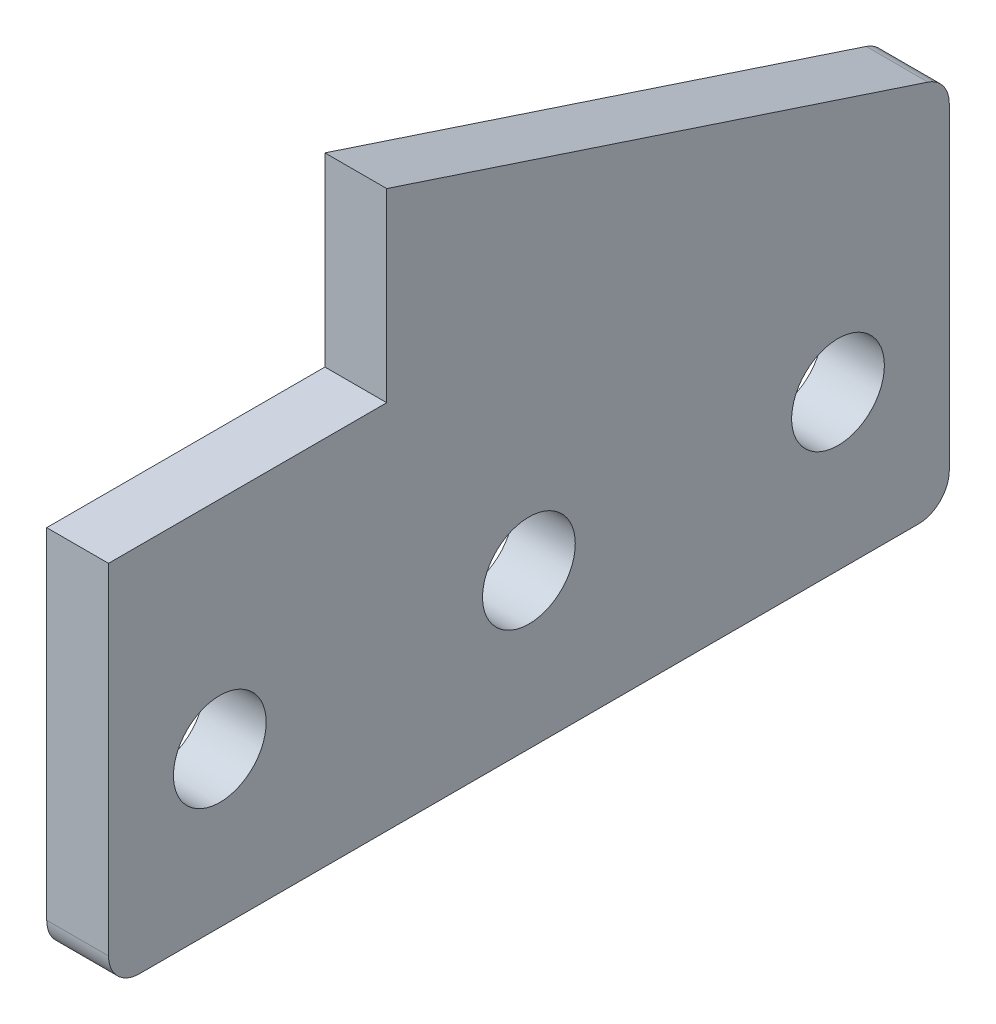
ISO-10303-21;
HEADER;
FILE_DESCRIPTION(('STEP AP214'),'2;1');
FILE_NAME('part.step','',(''),(''),'','','');
FILE_SCHEMA(('AUTOMOTIVE_DESIGN { 1 0 10303 214 1 1 1 1 }'));
ENDSEC;
DATA;
#1=APPLICATION_CONTEXT('core data for automotive mechanical design processes');
#2=APPLICATION_PROTOCOL_DEFINITION('international standard','automotive_design',2000,#1);
#3=PRODUCT_CONTEXT('',#1,'mechanical');
#4=PRODUCT('Part','Part','',(#3));
#5=PRODUCT_RELATED_PRODUCT_CATEGORY('part','',(#4));
#6=PRODUCT_DEFINITION_FORMATION('','',#4);
#7=PRODUCT_DEFINITION_CONTEXT('part definition',#1,'design');
#8=PRODUCT_DEFINITION('design','',#6,#7);
#9=PRODUCT_DEFINITION_SHAPE('','',#8);
#10=(LENGTH_UNIT() NAMED_UNIT(*) SI_UNIT(.MILLI.,.METRE.));
#11=(NAMED_UNIT(*) PLANE_ANGLE_UNIT() SI_UNIT($,.RADIAN.));
#12=(NAMED_UNIT(*) SI_UNIT($,.STERADIAN.) SOLID_ANGLE_UNIT());
#13=UNCERTAINTY_MEASURE_WITH_UNIT(LENGTH_MEASURE(1.E-05),#10,'distance_accuracy_value','');
#14=(GEOMETRIC_REPRESENTATION_CONTEXT(3) GLOBAL_UNCERTAINTY_ASSIGNED_CONTEXT((#13)) GLOBAL_UNIT_ASSIGNED_CONTEXT((#10,
#11,#12)) REPRESENTATION_CONTEXT('',''));
#15=CARTESIAN_POINT('',(0.,0.,0.));
#16=DIRECTION('',(0.,0.,1.));
#17=DIRECTION('',(1.,0.,0.));
#18=AXIS2_PLACEMENT_3D('',#15,#16,#17);
#19=CARTESIAN_POINT('',(-21.0000000000007,0.,-22.5));
#20=DIRECTION('',(0.,0.,1.));
#21=DIRECTION('',(1.,0.,0.));
#22=AXIS2_PLACEMENT_3D('',#19,#20,#21);
#23=PLANE('',#22);
#24=DIRECTION('',(0.,0.999999999999997,0.));
#25=VECTOR('',#24,1.);
#26=CARTESIAN_POINT('',(-31.0000000000002,0.,-22.4999999999995));
#27=LINE('',#26,#25);
#28=CARTESIAN_POINT('',(-31.0000000000004,-22.4999999999997,-22.4999999999989));
#29=VERTEX_POINT('',#28);
#30=CARTESIAN_POINT('',(-31.0000000000006,7.50000000000033,-22.4999999999995));
#31=VERTEX_POINT('',#30);
#32=EDGE_CURVE('E114',#29,#31,#27,.T.);
#33=ORIENTED_EDGE('',*,*,#32,.F.);
#34=DIRECTION('',(-1.,0.,0.));
#35=VECTOR('',#34,1.);
#36=CARTESIAN_POINT('',(-21.0000000000004,-22.4999999999995,-22.4999999999982));
#37=LINE('',#36,#35);
#38=CARTESIAN_POINT('',(-21.0000000000004,-22.4999999999995,-22.4999999999982));
#39=VERTEX_POINT('',#38);
#40=EDGE_CURVE('E109',#39,#29,#37,.T.);
#41=ORIENTED_EDGE('',*,*,#40,.F.);
#42=DIRECTION('',(0.,0.999999999999997,0.));
#43=VECTOR('',#42,1.);
#44=CARTESIAN_POINT('',(-21.0000000000007,0.,-22.5));
#45=LINE('',#44,#43);
#46=CARTESIAN_POINT('',(-21.,7.49999999999989,-22.5));
#47=VERTEX_POINT('',#46);
#48=EDGE_CURVE('E112',#39,#47,#45,.T.);
#49=ORIENTED_EDGE('',*,*,#48,.T.);
#50=DIRECTION('',(-1.,0.,0.));
#51=VECTOR('',#50,1.);
#52=CARTESIAN_POINT('',(-21.,7.49999999999989,-22.5));
#53=LINE('',#52,#51);
#54=EDGE_CURVE('E143',#47,#31,#53,.T.);
#55=ORIENTED_EDGE('',*,*,#54,.T.);
#56=EDGE_LOOP('',(#33,#41,#49,#55));
#57=FACE_BOUND('',#56,.T.);
#58=ADVANCED_FACE('F36',(#57),#23,.T.);
#59=CARTESIAN_POINT('',(-21.0000000000008,-22.4999999999998,1.33226762955019E-12));
#60=DIRECTION('',(0.,0.999999999999997,0.));
#61=DIRECTION('',(0.,0.,1.));
#62=AXIS2_PLACEMENT_3D('',#59,#60,#61);
#63=PLANE('',#62);
#64=DIRECTION('',(0.,0.,-1.));
#65=VECTOR('',#64,1.);
#66=CARTESIAN_POINT('',(-31.0000000000008,-22.4999999999994,1.77635683940025E-12));
#67=LINE('',#66,#65);
#68=CARTESIAN_POINT('',(-31.0000000000001,-22.4999999999998,22.5000000000013));
#69=VERTEX_POINT('',#68);
#70=EDGE_CURVE('E154',#69,#29,#67,.T.);
#71=ORIENTED_EDGE('',*,*,#70,.F.);
#72=DIRECTION('',(-1.,0.,0.));
#73=VECTOR('',#72,1.);
#74=CARTESIAN_POINT('',(-21.0000000000005,-22.5,22.5000000000011));
#75=LINE('',#74,#73);
#76=CARTESIAN_POINT('',(-21.0000000000005,-22.5,22.5000000000011));
#77=VERTEX_POINT('',#76);
#78=EDGE_CURVE('E120',#77,#69,#75,.T.);
#79=ORIENTED_EDGE('',*,*,#78,.F.);
#80=DIRECTION('',(0.,0.,-1.));
#81=VECTOR('',#80,1.);
#82=CARTESIAN_POINT('',(-21.0000000000008,-22.4999999999998,1.33226762955019E-12));
#83=LINE('',#82,#81);
#84=EDGE_CURVE('E125',#77,#39,#83,.T.);
#85=ORIENTED_EDGE('',*,*,#84,.T.);
#86=ORIENTED_EDGE('',*,*,#40,.T.);
#87=EDGE_LOOP('',(#71,#79,#85,#86));
#88=FACE_BOUND('',#87,.T.);
#89=ADVANCED_FACE('F130',(#88),#63,.T.);
#90=CARTESIAN_POINT('',(-21.0000000000001,0.,22.5));
#91=DIRECTION('',(0.,0.,-1.));
#92=DIRECTION('',(0.,0.999999999999997,0.));
#93=AXIS2_PLACEMENT_3D('',#90,#91,#92);
#94=PLANE('',#93);
#95=DIRECTION('',(0.,-0.999999999999997,0.));
#96=VECTOR('',#95,1.);
#97=CARTESIAN_POINT('',(-31.0000000000002,0.,22.5));
#98=LINE('',#97,#96);
#99=CARTESIAN_POINT('',(-31.0000000000004,-77.4999999999997,22.5000000000011));
#100=VERTEX_POINT('',#99);
#101=EDGE_CURVE('E156',#69,#100,#98,.T.);
#102=ORIENTED_EDGE('',*,*,#101,.T.);
#103=DIRECTION('',(-1.,0.,0.));
#104=VECTOR('',#103,1.);
#105=CARTESIAN_POINT('',(-21.0000000000001,-77.4999999999997,22.5000000000011));
#106=LINE('',#105,#104);
#107=CARTESIAN_POINT('',(-21.0000000000001,-77.4999999999997,22.5000000000011));
#108=VERTEX_POINT('',#107);
#109=EDGE_CURVE('E179',#100,#108,#106,.F.);
#110=ORIENTED_EDGE('',*,*,#109,.T.);
#111=DIRECTION('',(0.,-0.999999999999997,0.));
#112=VECTOR('',#111,1.);
#113=CARTESIAN_POINT('',(-21.0000000000001,0.,22.5));
#114=LINE('',#113,#112);
#115=EDGE_CURVE('E132',#77,#108,#114,.T.);
#116=ORIENTED_EDGE('',*,*,#115,.F.);
#117=ORIENTED_EDGE('',*,*,#78,.T.);
#118=EDGE_LOOP('',(#102,#110,#116,#117));
#119=FACE_BOUND('',#118,.T.);
#120=ADVANCED_FACE('F203',(#119),#94,.F.);
#121=CARTESIAN_POINT('',(-21.0000000000004,-82.4999999999996,1.11022302462516E-12));
#122=DIRECTION('',(0.,0.999999999999997,0.));
#123=DIRECTION('',(0.,0.,1.));
#124=AXIS2_PLACEMENT_3D('',#121,#122,#123);
#125=PLANE('',#124);
#126=DIRECTION('',(0.,0.,-1.));
#127=VECTOR('',#126,1.);
#128=CARTESIAN_POINT('',(-21.0000000000004,-82.4999999999996,1.11022302462516E-12));
#129=LINE('',#128,#127);
#130=CARTESIAN_POINT('',(-21.0000000000001,-82.4999999999995,17.5000000000014));
#131=VERTEX_POINT('',#130);
#132=CARTESIAN_POINT('',(-21.0000000000004,-82.4999999999999,-108.499999999999));
#133=VERTEX_POINT('',#132);
#134=EDGE_CURVE('E134',#131,#133,#129,.T.);
#135=ORIENTED_EDGE('',*,*,#134,.F.);
#136=DIRECTION('',(-1.,0.,0.));
#137=VECTOR('',#136,1.);
#138=CARTESIAN_POINT('',(-21.0000000000001,-82.4999999999995,17.5000000000014));
#139=LINE('',#138,#137);
#140=CARTESIAN_POINT('',(-31.0000000000006,-82.4999999999991,17.5000000000014));
#141=VERTEX_POINT('',#140);
#142=EDGE_CURVE('E170',#131,#141,#139,.T.);
#143=ORIENTED_EDGE('',*,*,#142,.T.);
#144=DIRECTION('',(0.,0.,-1.));
#145=VECTOR('',#144,1.);
#146=CARTESIAN_POINT('',(-31.0000000000006,-82.4999999999996,1.55431223447522E-12));
#147=LINE('',#146,#145);
#148=CARTESIAN_POINT('',(-31.0000000000006,-82.5000000000005,-108.499999999999));
#149=VERTEX_POINT('',#148);
#150=EDGE_CURVE('E159',#141,#149,#147,.T.);
#151=ORIENTED_EDGE('',*,*,#150,.T.);
#152=DIRECTION('',(-1.,0.,0.));
#153=VECTOR('',#152,1.);
#154=CARTESIAN_POINT('',(-21.0000000000004,-82.4999999999999,-108.499999999999));
#155=LINE('',#154,#153);
#156=EDGE_CURVE('E119',#149,#133,#155,.F.);
#157=ORIENTED_EDGE('',*,*,#156,.T.);
#158=EDGE_LOOP('',(#135,#143,#151,#157));
#159=FACE_BOUND('',#158,.T.);
#160=ADVANCED_FACE('F210',(#159),#125,.F.);
#161=CARTESIAN_POINT('',(-21.0000000000002,-2.08166817117217E-13,-113.5));
#162=DIRECTION('',(0.,0.,1.));
#163=DIRECTION('',(0.,-0.999999999999998,0.));
#164=AXIS2_PLACEMENT_3D('',#161,#162,#163);
#165=PLANE('',#164);
#166=DIRECTION('',(0.,0.999999999999998,0.));
#167=VECTOR('',#166,1.);
#168=CARTESIAN_POINT('',(-21.0000000000002,-2.08166817117217E-13,-113.5));
#169=LINE('',#168,#167);
#170=CARTESIAN_POINT('',(-21.0000000000007,-77.4999999999996,-113.499999999999));
#171=VERTEX_POINT('',#170);
#172=CARTESIAN_POINT('',(-21.0000000000006,-26.1163480730593,-113.499999999999));
#173=VERTEX_POINT('',#172);
#174=EDGE_CURVE('E140',#171,#173,#169,.T.);
#175=ORIENTED_EDGE('',*,*,#174,.F.);
#176=DIRECTION('',(-1.,0.,0.));
#177=VECTOR('',#176,1.);
#178=CARTESIAN_POINT('',(-21.0000000000007,-77.4999999999996,-113.499999999999));
#179=LINE('',#178,#177);
#180=CARTESIAN_POINT('',(-31.0000000000001,-77.5000000000006,-113.499999999999));
#181=VERTEX_POINT('',#180);
#182=EDGE_CURVE('E44',#171,#181,#179,.T.);
#183=ORIENTED_EDGE('',*,*,#182,.T.);
#184=DIRECTION('',(0.,0.999999999999998,0.));
#185=VECTOR('',#184,1.);
#186=CARTESIAN_POINT('',(-30.9999999999999,-2.08166817117217E-13,-113.5));
#187=LINE('',#186,#185);
#188=CARTESIAN_POINT('',(-31.0000000000006,-26.1163480730595,-113.499999999999));
#189=VERTEX_POINT('',#188);
#190=EDGE_CURVE('E162',#181,#189,#187,.T.);
#191=ORIENTED_EDGE('',*,*,#190,.T.);
#192=DIRECTION('',(-1.,0.,0.));
#193=VECTOR('',#192,1.);
#194=CARTESIAN_POINT('',(-21.0000000000006,-26.1163480730593,-113.499999999999));
#195=LINE('',#194,#193);
#196=EDGE_CURVE('E59',#189,#173,#195,.F.);
#197=ORIENTED_EDGE('',*,*,#196,.T.);
#198=EDGE_LOOP('',(#175,#183,#191,#197));
#199=FACE_BOUND('',#198,.T.);
#200=ADVANCED_FACE('F189',(#199),#165,.F.);
#201=CARTESIAN_POINT('',(-21.0000000000001,-57.4999999999994,4.5000000000015));
#202=DIRECTION('',(-1.,0.,0.));
#203=DIRECTION('',(0.,0.,1.));
#204=AXIS2_PLACEMENT_3D('',#201,#202,#203);
#205=CYLINDRICAL_SURFACE('',#204,7.5);
#206=CARTESIAN_POINT('',(-21.0000000000001,-57.4999999999994,4.5000000000015));
#207=DIRECTION('',(1.,0.,0.));
#208=DIRECTION('',(0.,0.,-1.));
#209=AXIS2_PLACEMENT_3D('',#206,#207,#208);
#210=CIRCLE('',#209,7.5);
#211=CARTESIAN_POINT('',(-21.0000000000001,-57.4999999999994,-2.99999999999852));
#212=VERTEX_POINT('',#211);
#213=EDGE_CURVE('E128',#212,#212,#210,.T.);
#214=ORIENTED_EDGE('',*,*,#213,.T.);
#215=EDGE_LOOP('',(#214));
#216=FACE_BOUND('',#215,.T.);
#217=CARTESIAN_POINT('',(-30.9999999999999,-57.4999999999995,4.5000000000015));
#218=DIRECTION('',(1.,0.,0.));
#219=DIRECTION('',(0.,0.,-1.));
#220=AXIS2_PLACEMENT_3D('',#217,#218,#219);
#221=CIRCLE('',#220,7.5);
#222=CARTESIAN_POINT('',(-30.9999999999999,-57.4999999999995,-2.99999999999852));
#223=VERTEX_POINT('',#222);
#224=EDGE_CURVE('E150',#223,#223,#221,.T.);
#225=ORIENTED_EDGE('',*,*,#224,.F.);
#226=EDGE_LOOP('',(#225));
#227=FACE_BOUND('',#226,.T.);
#228=ADVANCED_FACE('F227',(#216,#227),#205,.F.);
#229=CARTESIAN_POINT('',(-21.0000000000008,-57.4999999999995,-45.4999999999988));
#230=DIRECTION('',(-1.,0.,0.));
#231=DIRECTION('',(0.,0.,1.));
#232=AXIS2_PLACEMENT_3D('',#229,#230,#231);
#233=CYLINDRICAL_SURFACE('',#232,7.5);
#234=CARTESIAN_POINT('',(-21.0000000000008,-57.4999999999995,-45.4999999999988));
#235=DIRECTION('',(1.,0.,0.));
#236=DIRECTION('',(0.,0.,-1.));
#237=AXIS2_PLACEMENT_3D('',#234,#235,#236);
#238=CIRCLE('',#237,7.5);
#239=CARTESIAN_POINT('',(-21.0000000000008,-57.4999999999995,-52.9999999999988));
#240=VERTEX_POINT('',#239);
#241=EDGE_CURVE('E345',#240,#240,#238,.T.);
#242=ORIENTED_EDGE('',*,*,#241,.T.);
#243=EDGE_LOOP('',(#242));
#244=FACE_BOUND('',#243,.T.);
#245=CARTESIAN_POINT('',(-31.0000000000004,-57.4999999999997,-45.4999999999992));
#246=DIRECTION('',(1.,0.,0.));
#247=DIRECTION('',(0.,0.,-1.));
#248=AXIS2_PLACEMENT_3D('',#245,#246,#247);
#249=CIRCLE('',#248,7.5);
#250=CARTESIAN_POINT('',(-31.0000000000004,-57.4999999999997,-52.9999999999992));
#251=VERTEX_POINT('',#250);
#252=EDGE_CURVE('E147',#251,#251,#249,.T.);
#253=ORIENTED_EDGE('',*,*,#252,.F.);
#254=EDGE_LOOP('',(#253));
#255=FACE_BOUND('',#254,.T.);
#256=ADVANCED_FACE('F230',(#244,#255),#233,.F.);
#257=CARTESIAN_POINT('',(-21.0000000000004,-57.5000000000003,-95.4999999999988));
#258=DIRECTION('',(-1.,0.,0.));
#259=DIRECTION('',(0.,0.,1.));
#260=AXIS2_PLACEMENT_3D('',#257,#258,#259);
#261=CYLINDRICAL_SURFACE('',#260,7.5);
#262=CARTESIAN_POINT('',(-21.0000000000004,-57.5000000000003,-95.4999999999988));
#263=DIRECTION('',(1.,0.,0.));
#264=DIRECTION('',(0.,0.,-1.));
#265=AXIS2_PLACEMENT_3D('',#262,#263,#264);
#266=CIRCLE('',#265,7.5);
#267=CARTESIAN_POINT('',(-21.0000000000004,-57.5000000000003,-102.999999999999));
#268=VERTEX_POINT('',#267);
#269=EDGE_CURVE('E166',#268,#268,#266,.T.);
#270=ORIENTED_EDGE('',*,*,#269,.T.);
#271=EDGE_LOOP('',(#270));
#272=FACE_BOUND('',#271,.T.);
#273=CARTESIAN_POINT('',(-31.0000000000002,-57.5000000000001,-95.4999999999988));
#274=DIRECTION('',(1.,0.,0.));
#275=DIRECTION('',(0.,0.,-1.));
#276=AXIS2_PLACEMENT_3D('',#273,#274,#275);
#277=CIRCLE('',#276,7.5);
#278=CARTESIAN_POINT('',(-31.0000000000003,-57.5000000000001,-102.999999999999));
#279=VERTEX_POINT('',#278);
#280=EDGE_CURVE('E144',#279,#279,#277,.T.);
#281=ORIENTED_EDGE('',*,*,#280,.F.);
#282=EDGE_LOOP('',(#281));
#283=FACE_BOUND('',#282,.T.);
#284=ADVANCED_FACE('F234',(#272,#283),#261,.F.);
#285=CARTESIAN_POINT('',(-21.,13.4552336346802,-4.43579130813632));
#286=DIRECTION('',(0.,-0.949721781788548,0.313095092897325));
#287=DIRECTION('',(0.,-0.313095092897323,-0.949721781788551));
#288=AXIS2_PLACEMENT_3D('',#285,#286,#287);
#289=PLANE('',#288);
#290=DIRECTION('',(0.,0.313095092897323,0.949721781788551));
#291=VECTOR('',#290,1.);
#292=CARTESIAN_POINT('',(-21.,13.4552336346802,-4.43579130813632));
#293=LINE('',#292,#291);
#294=CARTESIAN_POINT('',(-21.0000000000002,-21.3677391641167,-110.065475464485));
#295=VERTEX_POINT('',#294);
#296=EDGE_CURVE('E126',#295,#47,#293,.T.);
#297=ORIENTED_EDGE('',*,*,#296,.F.);
#298=DIRECTION('',(-1.,0.,0.));
#299=VECTOR('',#298,1.);
#300=CARTESIAN_POINT('',(-21.0000000000002,-21.3677391641167,-110.065475464485));
#301=LINE('',#300,#299);
#302=CARTESIAN_POINT('',(-31.0000000000004,-21.3677391641165,-110.065475464486));
#303=VERTEX_POINT('',#302);
#304=EDGE_CURVE('E11',#295,#303,#301,.T.);
#305=ORIENTED_EDGE('',*,*,#304,.T.);
#306=DIRECTION('',(0.,0.313095092897323,0.949721781788551));
#307=VECTOR('',#306,1.);
#308=CARTESIAN_POINT('',(-31.0000000000002,13.4552336346805,-4.43579130813632));
#309=LINE('',#308,#307);
#310=EDGE_CURVE('E164',#303,#31,#309,.T.);
#311=ORIENTED_EDGE('',*,*,#310,.T.);
#312=ORIENTED_EDGE('',*,*,#54,.F.);
#313=EDGE_LOOP('',(#297,#305,#311,#312));
#314=FACE_BOUND('',#313,.T.);
#315=ADVANCED_FACE('F199',(#314),#289,.F.);
#316=CARTESIAN_POINT('',(-21.0000000000004,2.22044604925031E-13,4.44089209850063E-13));
#317=DIRECTION('',(1.,0.,0.));
#318=DIRECTION('',(0.,0.,-1.));
#319=AXIS2_PLACEMENT_3D('',#316,#317,#318);
#320=PLANE('',#319);
#321=ORIENTED_EDGE('',*,*,#269,.F.);
#322=EDGE_LOOP('',(#321));
#323=FACE_BOUND('',#322,.T.);
#324=ORIENTED_EDGE('',*,*,#241,.F.);
#325=EDGE_LOOP('',(#324));
#326=FACE_BOUND('',#325,.T.);
#327=ORIENTED_EDGE('',*,*,#213,.F.);
#328=EDGE_LOOP('',(#327));
#329=FACE_BOUND('',#328,.T.);
#330=ORIENTED_EDGE('',*,*,#115,.T.);
#331=CARTESIAN_POINT('',(-20.9999999999999,-77.4999999999999,17.500000000001));
#332=DIRECTION('',(1.,0.,0.));
#333=DIRECTION('',(0.,0.,-1.));
#334=AXIS2_PLACEMENT_3D('',#331,#332,#333);
#335=CIRCLE('',#334,5.);
#336=EDGE_CURVE('E184',#108,#131,#335,.T.);
#337=ORIENTED_EDGE('',*,*,#336,.T.);
#338=ORIENTED_EDGE('',*,*,#134,.T.);
#339=CARTESIAN_POINT('',(-21.0000000000004,-77.5,-108.499999999999));
#340=DIRECTION('',(1.,0.,0.));
#341=DIRECTION('',(0.,0.,-1.));
#342=AXIS2_PLACEMENT_3D('',#339,#340,#341);
#343=CIRCLE('',#342,5.);
#344=EDGE_CURVE('E182',#133,#171,#343,.T.);
#345=ORIENTED_EDGE('',*,*,#344,.T.);
#346=ORIENTED_EDGE('',*,*,#174,.T.);
#347=CARTESIAN_POINT('',(-21.0000000000001,-26.1163480730595,-108.499999999999));
#348=DIRECTION('',(1.,0.,0.));
#349=DIRECTION('',(0.,0.,-1.));
#350=AXIS2_PLACEMENT_3D('',#347,#348,#349);
#351=CIRCLE('',#350,5.);
#352=EDGE_CURVE('E51',#173,#295,#351,.T.);
#353=ORIENTED_EDGE('',*,*,#352,.T.);
#354=ORIENTED_EDGE('',*,*,#296,.T.);
#355=ORIENTED_EDGE('',*,*,#48,.F.);
#356=ORIENTED_EDGE('',*,*,#84,.F.);
#357=EDGE_LOOP('',(#330,#337,#338,#345,#346,#353,#354,#355,#356));
#358=FACE_BOUND('',#357,.T.);
#359=ADVANCED_FACE('F124',(#323,#326,#329,#358),#320,.T.);
#360=CARTESIAN_POINT('',(-31.0000000000002,0.,0.));
#361=DIRECTION('',(1.,0.,0.));
#362=DIRECTION('',(0.,0.,-1.));
#363=AXIS2_PLACEMENT_3D('',#360,#361,#362);
#364=PLANE('',#363);
#365=ORIENTED_EDGE('',*,*,#280,.T.);
#366=EDGE_LOOP('',(#365));
#367=FACE_BOUND('',#366,.T.);
#368=ORIENTED_EDGE('',*,*,#252,.T.);
#369=EDGE_LOOP('',(#368));
#370=FACE_BOUND('',#369,.T.);
#371=ORIENTED_EDGE('',*,*,#224,.T.);
#372=EDGE_LOOP('',(#371));
#373=FACE_BOUND('',#372,.T.);
#374=ORIENTED_EDGE('',*,*,#150,.F.);
#375=CARTESIAN_POINT('',(-31.0000000000002,-77.4999999999997,17.5000000000016));
#376=DIRECTION('',(1.,0.,0.));
#377=DIRECTION('',(0.,0.,-1.));
#378=AXIS2_PLACEMENT_3D('',#375,#376,#377);
#379=CIRCLE('',#378,5.);
#380=EDGE_CURVE('E177',#141,#100,#379,.F.);
#381=ORIENTED_EDGE('',*,*,#380,.T.);
#382=ORIENTED_EDGE('',*,*,#101,.F.);
#383=ORIENTED_EDGE('',*,*,#70,.T.);
#384=ORIENTED_EDGE('',*,*,#32,.T.);
#385=ORIENTED_EDGE('',*,*,#310,.F.);
#386=CARTESIAN_POINT('',(-31.0000000000004,-26.1163480730593,-108.499999999998));
#387=DIRECTION('',(1.,0.,0.));
#388=DIRECTION('',(0.,0.,-1.));
#389=AXIS2_PLACEMENT_3D('',#386,#387,#388);
#390=CIRCLE('',#389,5.);
#391=EDGE_CURVE('E173',#303,#189,#390,.F.);
#392=ORIENTED_EDGE('',*,*,#391,.T.);
#393=ORIENTED_EDGE('',*,*,#190,.F.);
#394=CARTESIAN_POINT('',(-31.0000000000006,-77.5000000000001,-108.499999999999));
#395=DIRECTION('',(1.,0.,0.));
#396=DIRECTION('',(0.,0.,-1.));
#397=AXIS2_PLACEMENT_3D('',#394,#395,#396);
#398=CIRCLE('',#397,5.);
#399=EDGE_CURVE('E175',#181,#149,#398,.F.);
#400=ORIENTED_EDGE('',*,*,#399,.T.);
#401=EDGE_LOOP('',(#374,#381,#382,#383,#384,#385,#392,#393,#400));
#402=FACE_BOUND('',#401,.T.);
#403=ADVANCED_FACE('F194',(#367,#370,#373,#402),#364,.F.);
#404=CARTESIAN_POINT('',(-20.9999999999999,-77.4999999999999,17.500000000001));
#405=DIRECTION('',(-1.,0.,0.));
#406=DIRECTION('',(0.,0.,1.));
#407=AXIS2_PLACEMENT_3D('',#404,#405,#406);
#408=CYLINDRICAL_SURFACE('',#407,5.);
#409=ORIENTED_EDGE('',*,*,#336,.F.);
#410=ORIENTED_EDGE('',*,*,#109,.F.);
#411=ORIENTED_EDGE('',*,*,#380,.F.);
#412=ORIENTED_EDGE('',*,*,#142,.F.);
#413=EDGE_LOOP('',(#409,#410,#411,#412));
#414=FACE_BOUND('',#413,.T.);
#415=ADVANCED_FACE('F206',(#414),#408,.T.);
#416=CARTESIAN_POINT('',(-21.0000000000004,-77.5,-108.499999999999));
#417=DIRECTION('',(-1.,0.,0.));
#418=DIRECTION('',(0.,0.,1.));
#419=AXIS2_PLACEMENT_3D('',#416,#417,#418);
#420=CYLINDRICAL_SURFACE('',#419,5.);
#421=ORIENTED_EDGE('',*,*,#344,.F.);
#422=ORIENTED_EDGE('',*,*,#156,.F.);
#423=ORIENTED_EDGE('',*,*,#399,.F.);
#424=ORIENTED_EDGE('',*,*,#182,.F.);
#425=EDGE_LOOP('',(#421,#422,#423,#424));
#426=FACE_BOUND('',#425,.T.);
#427=ADVANCED_FACE('F212',(#426),#420,.T.);
#428=CARTESIAN_POINT('',(-21.0000000000001,-26.1163480730595,-108.499999999999));
#429=DIRECTION('',(-1.,0.,0.));
#430=DIRECTION('',(0.,0.,1.));
#431=AXIS2_PLACEMENT_3D('',#428,#429,#430);
#432=CYLINDRICAL_SURFACE('',#431,5.);
#433=ORIENTED_EDGE('',*,*,#352,.F.);
#434=ORIENTED_EDGE('',*,*,#196,.F.);
#435=ORIENTED_EDGE('',*,*,#391,.F.);
#436=ORIENTED_EDGE('',*,*,#304,.F.);
#437=EDGE_LOOP('',(#433,#434,#435,#436));
#438=FACE_BOUND('',#437,.T.);
#439=ADVANCED_FACE('F38',(#438),#432,.T.);
#440=CLOSED_SHELL('',(#58,#89,#120,#160,#200,#228,#256,#284,#315,#359,#403,#415,#427,#439));
#441=MANIFOLD_SOLID_BREP('B2',#440);
#442=ADVANCED_BREP_SHAPE_REPRESENTATION('',(#18,#441),#14);
#443=SHAPE_DEFINITION_REPRESENTATION(#9,#442);
ENDSEC;
END-ISO-10303-21;
